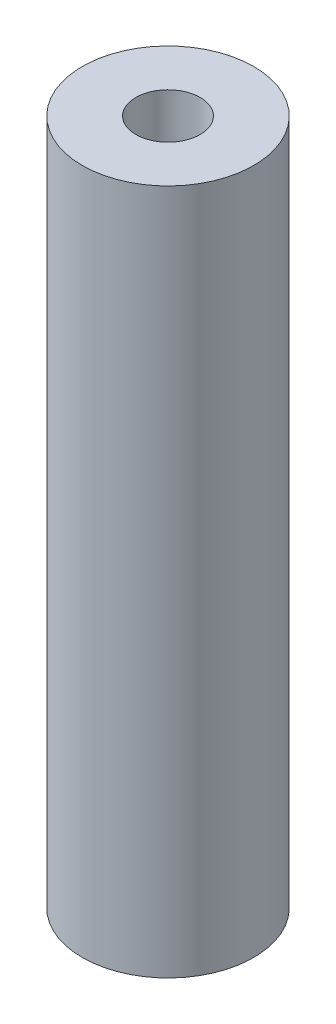
ISO-10303-21;
HEADER;
FILE_DESCRIPTION(('STEP AP214'),'2;1');
FILE_NAME('part.step','',(''),(''),'','','');
FILE_SCHEMA(('AUTOMOTIVE_DESIGN { 1 0 10303 214 1 1 1 1 }'));
ENDSEC;
DATA;
#1=APPLICATION_CONTEXT('core data for automotive mechanical design processes');
#2=APPLICATION_PROTOCOL_DEFINITION('international standard','automotive_design',2000,#1);
#3=PRODUCT_CONTEXT('',#1,'mechanical');
#4=PRODUCT('Part','Part','',(#3));
#5=PRODUCT_RELATED_PRODUCT_CATEGORY('part','',(#4));
#6=PRODUCT_DEFINITION_FORMATION('','',#4);
#7=PRODUCT_DEFINITION_CONTEXT('part definition',#1,'design');
#8=PRODUCT_DEFINITION('design','',#6,#7);
#9=PRODUCT_DEFINITION_SHAPE('','',#8);
#10=(LENGTH_UNIT() NAMED_UNIT(*) SI_UNIT(.MILLI.,.METRE.));
#11=(NAMED_UNIT(*) PLANE_ANGLE_UNIT() SI_UNIT($,.RADIAN.));
#12=(NAMED_UNIT(*) SI_UNIT($,.STERADIAN.) SOLID_ANGLE_UNIT());
#13=UNCERTAINTY_MEASURE_WITH_UNIT(LENGTH_MEASURE(1.E-05),#10,'distance_accuracy_value','');
#14=(GEOMETRIC_REPRESENTATION_CONTEXT(3) GLOBAL_UNCERTAINTY_ASSIGNED_CONTEXT((#13)) GLOBAL_UNIT_ASSIGNED_CONTEXT((#10,
#11,#12)) REPRESENTATION_CONTEXT('',''));
#15=CARTESIAN_POINT('',(0.,0.,0.));
#16=DIRECTION('',(0.,0.,1.));
#17=DIRECTION('',(1.,0.,0.));
#18=AXIS2_PLACEMENT_3D('',#15,#16,#17);
#19=CARTESIAN_POINT('',(0.,101.6,0.));
#20=DIRECTION('',(0.,1.,0.));
#21=DIRECTION('',(0.,0.,1.));
#22=AXIS2_PLACEMENT_3D('',#19,#20,#21);
#23=PLANE('',#22);
#24=CARTESIAN_POINT('',(0.,101.6,0.));
#25=DIRECTION('',(0.,1.,0.));
#26=DIRECTION('',(0.,0.,1.));
#27=AXIS2_PLACEMENT_3D('',#24,#25,#26);
#28=CIRCLE('',#27,12.7);
#29=CARTESIAN_POINT('',(0.,101.6,12.7));
#30=VERTEX_POINT('',#29);
#31=EDGE_CURVE('E10',#30,#30,#28,.T.);
#32=ORIENTED_EDGE('',*,*,#31,.T.);
#33=EDGE_LOOP('',(#32));
#34=FACE_BOUND('',#33,.T.);
#35=CARTESIAN_POINT('',(0.,101.6,0.));
#36=DIRECTION('',(0.,1.,0.));
#37=DIRECTION('',(0.,0.,1.));
#38=AXIS2_PLACEMENT_3D('',#35,#36,#37);
#39=CIRCLE('',#38,4.7625);
#40=CARTESIAN_POINT('',(0.,101.6,4.7625));
#41=VERTEX_POINT('',#40);
#42=EDGE_CURVE('E45',#41,#41,#39,.T.);
#43=ORIENTED_EDGE('',*,*,#42,.F.);
#44=EDGE_LOOP('',(#43));
#45=FACE_BOUND('',#44,.T.);
#46=ADVANCED_FACE('F34',(#34,#45),#23,.T.);
#47=CARTESIAN_POINT('',(0.,0.,0.));
#48=DIRECTION('',(0.,1.,0.));
#49=DIRECTION('',(0.,0.,1.));
#50=AXIS2_PLACEMENT_3D('',#47,#48,#49);
#51=PLANE('',#50);
#52=CARTESIAN_POINT('',(0.,0.,0.));
#53=DIRECTION('',(0.,1.,0.));
#54=DIRECTION('',(0.,0.,1.));
#55=AXIS2_PLACEMENT_3D('',#52,#53,#54);
#56=CIRCLE('',#55,12.7);
#57=CARTESIAN_POINT('',(0.,0.,12.7));
#58=VERTEX_POINT('',#57);
#59=EDGE_CURVE('E38',#58,#58,#56,.T.);
#60=ORIENTED_EDGE('',*,*,#59,.F.);
#61=EDGE_LOOP('',(#60));
#62=FACE_BOUND('',#61,.T.);
#63=CARTESIAN_POINT('',(0.,0.,0.));
#64=DIRECTION('',(0.,1.,0.));
#65=DIRECTION('',(0.,0.,1.));
#66=AXIS2_PLACEMENT_3D('',#63,#64,#65);
#67=CIRCLE('',#66,4.7625);
#68=CARTESIAN_POINT('',(0.,0.,4.7625));
#69=VERTEX_POINT('',#68);
#70=EDGE_CURVE('E47',#69,#69,#67,.T.);
#71=ORIENTED_EDGE('',*,*,#70,.T.);
#72=EDGE_LOOP('',(#71));
#73=FACE_BOUND('',#72,.T.);
#74=ADVANCED_FACE('F57',(#62,#73),#51,.F.);
#75=CARTESIAN_POINT('',(0.,101.6,0.));
#76=DIRECTION('',(0.,-1.,0.));
#77=DIRECTION('',(0.,0.,-1.));
#78=AXIS2_PLACEMENT_3D('',#75,#76,#77);
#79=CYLINDRICAL_SURFACE('',#78,12.7);
#80=ORIENTED_EDGE('',*,*,#31,.F.);
#81=EDGE_LOOP('',(#80));
#82=FACE_BOUND('',#81,.T.);
#83=ORIENTED_EDGE('',*,*,#59,.T.);
#84=EDGE_LOOP('',(#83));
#85=FACE_BOUND('',#84,.T.);
#86=ADVANCED_FACE('F36',(#82,#85),#79,.T.);
#87=CARTESIAN_POINT('',(0.,101.6,0.));
#88=DIRECTION('',(0.,-1.,0.));
#89=DIRECTION('',(0.,0.,-1.));
#90=AXIS2_PLACEMENT_3D('',#87,#88,#89);
#91=CYLINDRICAL_SURFACE('',#90,4.7625);
#92=ORIENTED_EDGE('',*,*,#42,.T.);
#93=EDGE_LOOP('',(#92));
#94=FACE_BOUND('',#93,.T.);
#95=ORIENTED_EDGE('',*,*,#70,.F.);
#96=EDGE_LOOP('',(#95));
#97=FACE_BOUND('',#96,.T.);
#98=ADVANCED_FACE('F53',(#94,#97),#91,.F.);
#99=CLOSED_SHELL('',(#46,#74,#86,#98));
#100=MANIFOLD_SOLID_BREP('B2',#99);
#101=ADVANCED_BREP_SHAPE_REPRESENTATION('',(#18,#100),#14);
#102=SHAPE_DEFINITION_REPRESENTATION(#9,#101);
ENDSEC;
END-ISO-10303-21;
